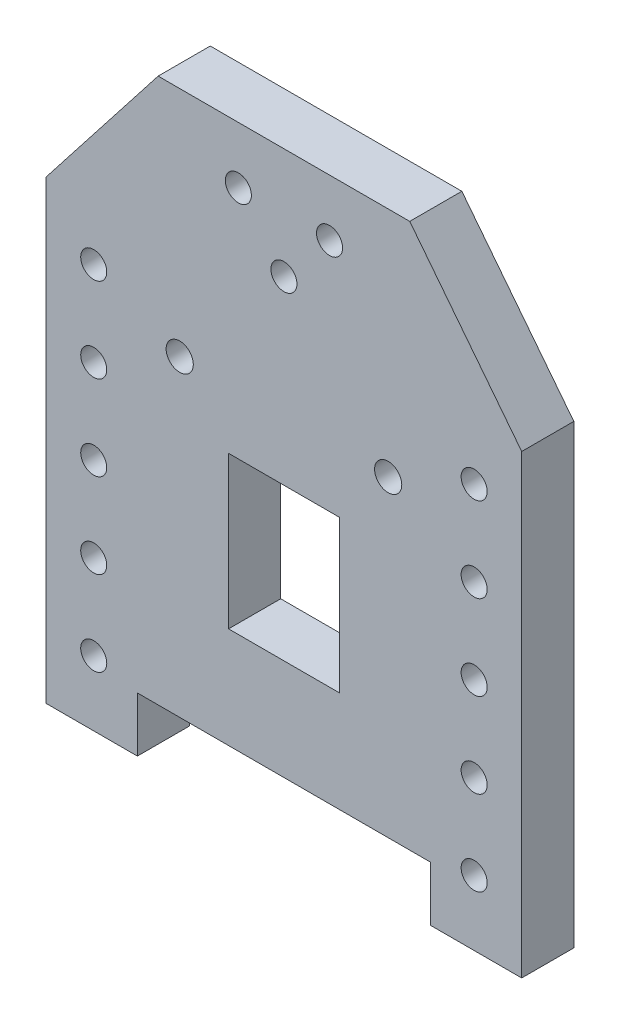
ISO-10303-21;
HEADER;
FILE_DESCRIPTION(('STEP AP214'),'2;1');
FILE_NAME('part.step','',(''),(''),'','','');
FILE_SCHEMA(('AUTOMOTIVE_DESIGN { 1 0 10303 214 1 1 1 1 }'));
ENDSEC;
DATA;
#1=APPLICATION_CONTEXT('core data for automotive mechanical design processes');
#2=APPLICATION_PROTOCOL_DEFINITION('international standard','automotive_design',2000,#1);
#3=PRODUCT_CONTEXT('',#1,'mechanical');
#4=PRODUCT('Part','Part','',(#3));
#5=PRODUCT_RELATED_PRODUCT_CATEGORY('part','',(#4));
#6=PRODUCT_DEFINITION_FORMATION('','',#4);
#7=PRODUCT_DEFINITION_CONTEXT('part definition',#1,'design');
#8=PRODUCT_DEFINITION('design','',#6,#7);
#9=PRODUCT_DEFINITION_SHAPE('','',#8);
#10=(LENGTH_UNIT() NAMED_UNIT(*) SI_UNIT(.MILLI.,.METRE.));
#11=(NAMED_UNIT(*) PLANE_ANGLE_UNIT() SI_UNIT($,.RADIAN.));
#12=(NAMED_UNIT(*) SI_UNIT($,.STERADIAN.) SOLID_ANGLE_UNIT());
#13=UNCERTAINTY_MEASURE_WITH_UNIT(LENGTH_MEASURE(1.E-05),#10,'distance_accuracy_value','');
#14=(GEOMETRIC_REPRESENTATION_CONTEXT(3) GLOBAL_UNCERTAINTY_ASSIGNED_CONTEXT((#13)) GLOBAL_UNIT_ASSIGNED_CONTEXT((#10,
#11,#12)) REPRESENTATION_CONTEXT('',''));
#15=CARTESIAN_POINT('',(0.,0.,0.));
#16=DIRECTION('',(0.,0.,1.));
#17=DIRECTION('',(1.,0.,0.));
#18=AXIS2_PLACEMENT_3D('',#15,#16,#17);
#19=CARTESIAN_POINT('',(0.,0.,8.));
#20=DIRECTION('',(0.,0.,1.));
#21=DIRECTION('',(1.,0.,0.));
#22=AXIS2_PLACEMENT_3D('',#19,#20,#21);
#23=PLANE('',#22);
#24=CARTESIAN_POINT('',(29.2000000000002,62.,8.));
#25=DIRECTION('',(0.,0.,-1.));
#26=DIRECTION('',(-1.,0.,0.));
#27=AXIS2_PLACEMENT_3D('',#24,#25,#26);
#28=CIRCLE('',#27,1.99999999999999);
#29=CARTESIAN_POINT('',(27.2000000000002,62.,8.));
#30=VERTEX_POINT('',#29);
#31=EDGE_CURVE('E579',#30,#30,#28,.T.);
#32=ORIENTED_EDGE('',*,*,#31,.T.);
#33=EDGE_LOOP('',(#32));
#34=FACE_BOUND('',#33,.T.);
#35=CARTESIAN_POINT('',(29.2000000000001,49.,8.));
#36=DIRECTION('',(0.,0.,-1.));
#37=DIRECTION('',(-1.,0.,0.));
#38=AXIS2_PLACEMENT_3D('',#35,#36,#37);
#39=CIRCLE('',#38,1.99999999999998);
#40=CARTESIAN_POINT('',(27.2000000000002,49.,8.));
#41=VERTEX_POINT('',#40);
#42=EDGE_CURVE('E587',#41,#41,#39,.T.);
#43=ORIENTED_EDGE('',*,*,#42,.T.);
#44=EDGE_LOOP('',(#43));
#45=FACE_BOUND('',#44,.T.);
#46=CARTESIAN_POINT('',(29.2000000000001,36.,8.));
#47=DIRECTION('',(0.,0.,-1.));
#48=DIRECTION('',(-1.,0.,0.));
#49=AXIS2_PLACEMENT_3D('',#46,#47,#48);
#50=CIRCLE('',#49,1.99999999999998);
#51=CARTESIAN_POINT('',(27.2000000000001,36.,8.));
#52=VERTEX_POINT('',#51);
#53=EDGE_CURVE('E593',#52,#52,#50,.T.);
#54=ORIENTED_EDGE('',*,*,#53,.T.);
#55=EDGE_LOOP('',(#54));
#56=FACE_BOUND('',#55,.T.);
#57=CARTESIAN_POINT('',(29.2,23.,8.));
#58=DIRECTION('',(0.,0.,-1.));
#59=DIRECTION('',(-1.,0.,0.));
#60=AXIS2_PLACEMENT_3D('',#57,#58,#59);
#61=CIRCLE('',#60,1.99999999999998);
#62=CARTESIAN_POINT('',(27.2000000000001,23.,8.));
#63=VERTEX_POINT('',#62);
#64=EDGE_CURVE('E599',#63,#63,#61,.T.);
#65=ORIENTED_EDGE('',*,*,#64,.T.);
#66=EDGE_LOOP('',(#65));
#67=FACE_BOUND('',#66,.T.);
#68=CARTESIAN_POINT('',(-29.1999999999998,62.,8.));
#69=DIRECTION('',(0.,0.,-1.));
#70=DIRECTION('',(-1.,0.,0.));
#71=AXIS2_PLACEMENT_3D('',#68,#69,#70);
#72=CIRCLE('',#71,1.99999999999999);
#73=CARTESIAN_POINT('',(-31.1999999999998,62.,8.));
#74=VERTEX_POINT('',#73);
#75=EDGE_CURVE('E605',#74,#74,#72,.T.);
#76=ORIENTED_EDGE('',*,*,#75,.T.);
#77=EDGE_LOOP('',(#76));
#78=FACE_BOUND('',#77,.T.);
#79=CARTESIAN_POINT('',(-29.1999999999999,49.,8.));
#80=DIRECTION('',(0.,0.,-1.));
#81=DIRECTION('',(-1.,0.,0.));
#82=AXIS2_PLACEMENT_3D('',#79,#80,#81);
#83=CIRCLE('',#82,1.99999999999998);
#84=CARTESIAN_POINT('',(-31.1999999999999,49.,8.));
#85=VERTEX_POINT('',#84);
#86=EDGE_CURVE('E611',#85,#85,#83,.T.);
#87=ORIENTED_EDGE('',*,*,#86,.T.);
#88=EDGE_LOOP('',(#87));
#89=FACE_BOUND('',#88,.T.);
#90=CARTESIAN_POINT('',(-29.1999999999999,36.,8.));
#91=DIRECTION('',(0.,0.,-1.));
#92=DIRECTION('',(-1.,0.,0.));
#93=AXIS2_PLACEMENT_3D('',#90,#91,#92);
#94=CIRCLE('',#93,1.99999999999998);
#95=CARTESIAN_POINT('',(-31.1999999999999,36.,8.));
#96=VERTEX_POINT('',#95);
#97=EDGE_CURVE('E617',#96,#96,#94,.T.);
#98=ORIENTED_EDGE('',*,*,#97,.T.);
#99=EDGE_LOOP('',(#98));
#100=FACE_BOUND('',#99,.T.);
#101=CARTESIAN_POINT('',(-29.2,23.,8.));
#102=DIRECTION('',(0.,0.,-1.));
#103=DIRECTION('',(-1.,0.,0.));
#104=AXIS2_PLACEMENT_3D('',#101,#102,#103);
#105=CIRCLE('',#104,1.99999999999998);
#106=CARTESIAN_POINT('',(-31.1999999999999,23.,8.));
#107=VERTEX_POINT('',#106);
#108=EDGE_CURVE('E623',#107,#107,#105,.T.);
#109=ORIENTED_EDGE('',*,*,#108,.T.);
#110=EDGE_LOOP('',(#109));
#111=FACE_BOUND('',#110,.T.);
#112=CARTESIAN_POINT('',(-29.2,10.,8.));
#113=DIRECTION('',(0.,0.,1.));
#114=DIRECTION('',(1.,0.,0.));
#115=AXIS2_PLACEMENT_3D('',#112,#113,#114);
#116=CIRCLE('',#115,1.99999999999999);
#117=CARTESIAN_POINT('',(-27.2,10.,8.));
#118=VERTEX_POINT('',#117);
#119=EDGE_CURVE('E635',#118,#118,#116,.T.);
#120=ORIENTED_EDGE('',*,*,#119,.F.);
#121=EDGE_LOOP('',(#120));
#122=FACE_BOUND('',#121,.T.);
#123=CARTESIAN_POINT('',(-7.,83.3,8.));
#124=DIRECTION('',(0.,0.,1.));
#125=DIRECTION('',(1.,0.,0.));
#126=AXIS2_PLACEMENT_3D('',#123,#124,#125);
#127=CIRCLE('',#126,1.99999999999999);
#128=CARTESIAN_POINT('',(-5.00000000000001,83.3,8.));
#129=VERTEX_POINT('',#128);
#130=EDGE_CURVE('E647',#129,#129,#127,.T.);
#131=ORIENTED_EDGE('',*,*,#130,.F.);
#132=EDGE_LOOP('',(#131));
#133=FACE_BOUND('',#132,.T.);
#134=CARTESIAN_POINT('',(16.,56.3545405745842,8.));
#135=DIRECTION('',(0.,0.,1.));
#136=DIRECTION('',(1.,0.,0.));
#137=AXIS2_PLACEMENT_3D('',#134,#135,#136);
#138=CIRCLE('',#137,2.08671795340706);
#139=CARTESIAN_POINT('',(18.0867179534071,56.3545405745842,8.));
#140=VERTEX_POINT('',#139);
#141=EDGE_CURVE('E659',#140,#140,#138,.T.);
#142=ORIENTED_EDGE('',*,*,#141,.F.);
#143=EDGE_LOOP('',(#142));
#144=FACE_BOUND('',#143,.T.);
#145=DIRECTION('',(1.,0.,0.));
#146=VECTOR('',#145,1.);
#147=CARTESIAN_POINT('',(0.,23.9176826946673,8.));
#148=LINE('',#147,#146);
#149=CARTESIAN_POINT('',(-8.5,23.9176826946673,8.));
#150=VERTEX_POINT('',#149);
#151=CARTESIAN_POINT('',(8.5,23.9176826946673,8.));
#152=VERTEX_POINT('',#151);
#153=EDGE_CURVE('E151',#150,#152,#148,.T.);
#154=ORIENTED_EDGE('',*,*,#153,.F.);
#155=DIRECTION('',(0.,-1.,0.));
#156=VECTOR('',#155,1.);
#157=CARTESIAN_POINT('',(-8.5,47.2571297161517,8.));
#158=LINE('',#157,#156);
#159=CARTESIAN_POINT('',(-8.5,47.2571297161517,8.));
#160=VERTEX_POINT('',#159);
#161=EDGE_CURVE('E136',#160,#150,#158,.T.);
#162=ORIENTED_EDGE('',*,*,#161,.F.);
#163=DIRECTION('',(-1.,0.,0.));
#164=VECTOR('',#163,1.);
#165=CARTESIAN_POINT('',(0.,47.2571297161517,8.));
#166=LINE('',#165,#164);
#167=CARTESIAN_POINT('',(8.5,47.2571297161517,8.));
#168=VERTEX_POINT('',#167);
#169=EDGE_CURVE('E131',#168,#160,#166,.T.);
#170=ORIENTED_EDGE('',*,*,#169,.F.);
#171=DIRECTION('',(0.,1.,0.));
#172=VECTOR('',#171,1.);
#173=CARTESIAN_POINT('',(8.5,47.2571297161517,8.));
#174=LINE('',#173,#172);
#175=EDGE_CURVE('E153',#152,#168,#174,.T.);
#176=ORIENTED_EDGE('',*,*,#175,.F.);
#177=EDGE_LOOP('',(#154,#162,#170,#176));
#178=FACE_BOUND('',#177,.T.);
#179=DIRECTION('',(-0.615661475322374,0.788010753609288,0.));
#180=VECTOR('',#179,1.);
#181=CARTESIAN_POINT('',(36.5,70.0000000000001,8.));
#182=LINE('',#181,#180);
#183=CARTESIAN_POINT('',(36.5,70.0000000000001,8.));
#184=VERTEX_POINT('',#183);
#185=CARTESIAN_POINT('',(19.311716217,92.,8.));
#186=VERTEX_POINT('',#185);
#187=EDGE_CURVE('E171',#184,#186,#182,.T.);
#188=ORIENTED_EDGE('',*,*,#187,.T.);
#189=DIRECTION('',(-1.,0.,0.));
#190=VECTOR('',#189,1.);
#191=CARTESIAN_POINT('',(19.311716217,92.,8.));
#192=LINE('',#191,#190);
#193=CARTESIAN_POINT('',(-19.311716217,92.,8.));
#194=VERTEX_POINT('',#193);
#195=EDGE_CURVE('E174',#186,#194,#192,.T.);
#196=ORIENTED_EDGE('',*,*,#195,.T.);
#197=DIRECTION('',(-0.615661475322369,-0.788010753609292,0.));
#198=VECTOR('',#197,1.);
#199=CARTESIAN_POINT('',(-19.311716217,92.,8.));
#200=LINE('',#199,#198);
#201=CARTESIAN_POINT('',(-36.5,69.9999999999999,8.));
#202=VERTEX_POINT('',#201);
#203=EDGE_CURVE('E177',#194,#202,#200,.T.);
#204=ORIENTED_EDGE('',*,*,#203,.T.);
#205=DIRECTION('',(0.,-1.,0.));
#206=VECTOR('',#205,1.);
#207=CARTESIAN_POINT('',(-36.5,69.9999999999999,8.));
#208=LINE('',#207,#206);
#209=CARTESIAN_POINT('',(-36.5,0.,8.));
#210=VERTEX_POINT('',#209);
#211=EDGE_CURVE('E179',#202,#210,#208,.T.);
#212=ORIENTED_EDGE('',*,*,#211,.T.);
#213=DIRECTION('',(1.,0.,0.));
#214=VECTOR('',#213,1.);
#215=CARTESIAN_POINT('',(-36.5,0.,8.));
#216=LINE('',#215,#214);
#217=CARTESIAN_POINT('',(-22.4999999985,0.,8.));
#218=VERTEX_POINT('',#217);
#219=EDGE_CURVE('E181',#210,#218,#216,.T.);
#220=ORIENTED_EDGE('',*,*,#219,.T.);
#221=DIRECTION('',(0.,1.,0.));
#222=VECTOR('',#221,1.);
#223=CARTESIAN_POINT('',(-22.4999999985,0.,8.));
#224=LINE('',#223,#222);
#225=CARTESIAN_POINT('',(-22.4999999985,8.400000004,8.));
#226=VERTEX_POINT('',#225);
#227=EDGE_CURVE('E183',#218,#226,#224,.T.);
#228=ORIENTED_EDGE('',*,*,#227,.T.);
#229=DIRECTION('',(1.,0.,0.));
#230=VECTOR('',#229,1.);
#231=CARTESIAN_POINT('',(-22.4999999985,8.400000004,8.));
#232=LINE('',#231,#230);
#233=CARTESIAN_POINT('',(22.4999999985,8.400000004,8.));
#234=VERTEX_POINT('',#233);
#235=EDGE_CURVE('E185',#226,#234,#232,.T.);
#236=ORIENTED_EDGE('',*,*,#235,.T.);
#237=DIRECTION('',(0.,-1.,0.));
#238=VECTOR('',#237,1.);
#239=CARTESIAN_POINT('',(22.4999999985,8.400000004,8.));
#240=LINE('',#239,#238);
#241=CARTESIAN_POINT('',(22.4999999985,0.,8.));
#242=VERTEX_POINT('',#241);
#243=EDGE_CURVE('E187',#234,#242,#240,.T.);
#244=ORIENTED_EDGE('',*,*,#243,.T.);
#245=DIRECTION('',(1.,0.,0.));
#246=VECTOR('',#245,1.);
#247=CARTESIAN_POINT('',(22.4999999985,0.,8.));
#248=LINE('',#247,#246);
#249=CARTESIAN_POINT('',(36.5,0.,8.));
#250=VERTEX_POINT('',#249);
#251=EDGE_CURVE('E189',#242,#250,#248,.T.);
#252=ORIENTED_EDGE('',*,*,#251,.T.);
#253=DIRECTION('',(0.,1.,0.));
#254=VECTOR('',#253,1.);
#255=CARTESIAN_POINT('',(36.5,0.,8.));
#256=LINE('',#255,#254);
#257=EDGE_CURVE('E191',#250,#184,#256,.T.);
#258=ORIENTED_EDGE('',*,*,#257,.T.);
#259=EDGE_LOOP('',(#188,#196,#204,#212,#220,#228,#236,#244,#252,#258));
#260=FACE_BOUND('',#259,.T.);
#261=CARTESIAN_POINT('',(-16.,56.3545405745842,8.));
#262=DIRECTION('',(0.,0.,1.));
#263=DIRECTION('',(1.,0.,0.));
#264=AXIS2_PLACEMENT_3D('',#261,#262,#263);
#265=CIRCLE('',#264,2.0867160921528);
#266=CARTESIAN_POINT('',(-13.9132839078472,56.3545405745842,8.));
#267=VERTEX_POINT('',#266);
#268=EDGE_CURVE('E160',#267,#267,#265,.T.);
#269=ORIENTED_EDGE('',*,*,#268,.F.);
#270=EDGE_LOOP('',(#269));
#271=FACE_BOUND('',#270,.T.);
#272=CARTESIAN_POINT('',(0.,75.,8.));
#273=DIRECTION('',(0.,0.,1.));
#274=DIRECTION('',(1.,0.,0.));
#275=AXIS2_PLACEMENT_3D('',#272,#273,#274);
#276=CIRCLE('',#275,1.99999999999999);
#277=CARTESIAN_POINT('',(1.99999999999999,75.,8.));
#278=VERTEX_POINT('',#277);
#279=EDGE_CURVE('E653',#278,#278,#276,.T.);
#280=ORIENTED_EDGE('',*,*,#279,.F.);
#281=EDGE_LOOP('',(#280));
#282=FACE_BOUND('',#281,.T.);
#283=CARTESIAN_POINT('',(7.,83.3,8.));
#284=DIRECTION('',(0.,0.,1.));
#285=DIRECTION('',(1.,0.,0.));
#286=AXIS2_PLACEMENT_3D('',#283,#284,#285);
#287=CIRCLE('',#286,1.99999999999999);
#288=CARTESIAN_POINT('',(8.99999999999999,83.3,8.));
#289=VERTEX_POINT('',#288);
#290=EDGE_CURVE('E641',#289,#289,#287,.T.);
#291=ORIENTED_EDGE('',*,*,#290,.F.);
#292=EDGE_LOOP('',(#291));
#293=FACE_BOUND('',#292,.T.);
#294=CARTESIAN_POINT('',(29.2,10.,8.));
#295=DIRECTION('',(0.,0.,1.));
#296=DIRECTION('',(1.,0.,0.));
#297=AXIS2_PLACEMENT_3D('',#294,#295,#296);
#298=CIRCLE('',#297,1.99999999999999);
#299=CARTESIAN_POINT('',(31.2,10.,8.));
#300=VERTEX_POINT('',#299);
#301=EDGE_CURVE('E629',#300,#300,#298,.T.);
#302=ORIENTED_EDGE('',*,*,#301,.F.);
#303=EDGE_LOOP('',(#302));
#304=FACE_BOUND('',#303,.T.);
#305=ADVANCED_FACE('F33',(#34,#45,#56,#67,#78,#89,#100,#111,#122,#133,#144,#178,#260,#271,#282,
#293,#304),#23,.T.);
#306=CARTESIAN_POINT('',(0.,0.,0.));
#307=DIRECTION('',(0.,0.,1.));
#308=DIRECTION('',(1.,0.,0.));
#309=AXIS2_PLACEMENT_3D('',#306,#307,#308);
#310=PLANE('',#309);
#311=CARTESIAN_POINT('',(29.2000000000002,62.,0.));
#312=DIRECTION('',(0.,0.,-1.));
#313=DIRECTION('',(-1.,0.,0.));
#314=AXIS2_PLACEMENT_3D('',#311,#312,#313);
#315=CIRCLE('',#314,1.99999999999999);
#316=CARTESIAN_POINT('',(27.2000000000002,62.,0.));
#317=VERTEX_POINT('',#316);
#318=EDGE_CURVE('E582',#317,#317,#315,.T.);
#319=ORIENTED_EDGE('',*,*,#318,.F.);
#320=EDGE_LOOP('',(#319));
#321=FACE_BOUND('',#320,.T.);
#322=CARTESIAN_POINT('',(29.2000000000001,49.,0.));
#323=DIRECTION('',(0.,0.,-1.));
#324=DIRECTION('',(-1.,0.,0.));
#325=AXIS2_PLACEMENT_3D('',#322,#323,#324);
#326=CIRCLE('',#325,1.99999999999998);
#327=CARTESIAN_POINT('',(27.2000000000002,49.,0.));
#328=VERTEX_POINT('',#327);
#329=EDGE_CURVE('E584',#328,#328,#326,.T.);
#330=ORIENTED_EDGE('',*,*,#329,.F.);
#331=EDGE_LOOP('',(#330));
#332=FACE_BOUND('',#331,.T.);
#333=CARTESIAN_POINT('',(29.2000000000001,36.,0.));
#334=DIRECTION('',(0.,0.,-1.));
#335=DIRECTION('',(-1.,0.,0.));
#336=AXIS2_PLACEMENT_3D('',#333,#334,#335);
#337=CIRCLE('',#336,1.99999999999998);
#338=CARTESIAN_POINT('',(27.2000000000001,36.,0.));
#339=VERTEX_POINT('',#338);
#340=EDGE_CURVE('E590',#339,#339,#337,.T.);
#341=ORIENTED_EDGE('',*,*,#340,.F.);
#342=EDGE_LOOP('',(#341));
#343=FACE_BOUND('',#342,.T.);
#344=CARTESIAN_POINT('',(29.2,23.,0.));
#345=DIRECTION('',(0.,0.,-1.));
#346=DIRECTION('',(-1.,0.,0.));
#347=AXIS2_PLACEMENT_3D('',#344,#345,#346);
#348=CIRCLE('',#347,1.99999999999998);
#349=CARTESIAN_POINT('',(27.2000000000001,23.,0.));
#350=VERTEX_POINT('',#349);
#351=EDGE_CURVE('E596',#350,#350,#348,.T.);
#352=ORIENTED_EDGE('',*,*,#351,.F.);
#353=EDGE_LOOP('',(#352));
#354=FACE_BOUND('',#353,.T.);
#355=CARTESIAN_POINT('',(-29.1999999999998,62.,0.));
#356=DIRECTION('',(0.,0.,-1.));
#357=DIRECTION('',(-1.,0.,0.));
#358=AXIS2_PLACEMENT_3D('',#355,#356,#357);
#359=CIRCLE('',#358,1.99999999999999);
#360=CARTESIAN_POINT('',(-31.1999999999998,62.,0.));
#361=VERTEX_POINT('',#360);
#362=EDGE_CURVE('E602',#361,#361,#359,.T.);
#363=ORIENTED_EDGE('',*,*,#362,.F.);
#364=EDGE_LOOP('',(#363));
#365=FACE_BOUND('',#364,.T.);
#366=CARTESIAN_POINT('',(-29.1999999999999,49.,0.));
#367=DIRECTION('',(0.,0.,-1.));
#368=DIRECTION('',(-1.,0.,0.));
#369=AXIS2_PLACEMENT_3D('',#366,#367,#368);
#370=CIRCLE('',#369,1.99999999999998);
#371=CARTESIAN_POINT('',(-31.1999999999999,49.,0.));
#372=VERTEX_POINT('',#371);
#373=EDGE_CURVE('E608',#372,#372,#370,.T.);
#374=ORIENTED_EDGE('',*,*,#373,.F.);
#375=EDGE_LOOP('',(#374));
#376=FACE_BOUND('',#375,.T.);
#377=CARTESIAN_POINT('',(-29.1999999999999,36.,0.));
#378=DIRECTION('',(0.,0.,-1.));
#379=DIRECTION('',(-1.,0.,0.));
#380=AXIS2_PLACEMENT_3D('',#377,#378,#379);
#381=CIRCLE('',#380,1.99999999999998);
#382=CARTESIAN_POINT('',(-31.1999999999999,36.,0.));
#383=VERTEX_POINT('',#382);
#384=EDGE_CURVE('E614',#383,#383,#381,.T.);
#385=ORIENTED_EDGE('',*,*,#384,.F.);
#386=EDGE_LOOP('',(#385));
#387=FACE_BOUND('',#386,.T.);
#388=CARTESIAN_POINT('',(-29.2,23.,0.));
#389=DIRECTION('',(0.,0.,-1.));
#390=DIRECTION('',(-1.,0.,0.));
#391=AXIS2_PLACEMENT_3D('',#388,#389,#390);
#392=CIRCLE('',#391,1.99999999999998);
#393=CARTESIAN_POINT('',(-31.1999999999999,23.,0.));
#394=VERTEX_POINT('',#393);
#395=EDGE_CURVE('E620',#394,#394,#392,.T.);
#396=ORIENTED_EDGE('',*,*,#395,.F.);
#397=EDGE_LOOP('',(#396));
#398=FACE_BOUND('',#397,.T.);
#399=CARTESIAN_POINT('',(-29.2,10.,0.));
#400=DIRECTION('',(0.,0.,1.));
#401=DIRECTION('',(1.,0.,0.));
#402=AXIS2_PLACEMENT_3D('',#399,#400,#401);
#403=CIRCLE('',#402,1.99999999999999);
#404=CARTESIAN_POINT('',(-27.2,10.,0.));
#405=VERTEX_POINT('',#404);
#406=EDGE_CURVE('E632',#405,#405,#403,.T.);
#407=ORIENTED_EDGE('',*,*,#406,.T.);
#408=EDGE_LOOP('',(#407));
#409=FACE_BOUND('',#408,.T.);
#410=CARTESIAN_POINT('',(-7.,83.3,0.));
#411=DIRECTION('',(0.,0.,1.));
#412=DIRECTION('',(1.,0.,0.));
#413=AXIS2_PLACEMENT_3D('',#410,#411,#412);
#414=CIRCLE('',#413,1.99999999999999);
#415=CARTESIAN_POINT('',(-5.00000000000001,83.3,0.));
#416=VERTEX_POINT('',#415);
#417=EDGE_CURVE('E644',#416,#416,#414,.T.);
#418=ORIENTED_EDGE('',*,*,#417,.T.);
#419=EDGE_LOOP('',(#418));
#420=FACE_BOUND('',#419,.T.);
#421=CARTESIAN_POINT('',(16.,56.3545405745842,0.));
#422=DIRECTION('',(0.,0.,1.));
#423=DIRECTION('',(1.,0.,0.));
#424=AXIS2_PLACEMENT_3D('',#421,#422,#423);
#425=CIRCLE('',#424,2.08671795340706);
#426=CARTESIAN_POINT('',(18.0867179534071,56.3545405745842,0.));
#427=VERTEX_POINT('',#426);
#428=EDGE_CURVE('E656',#427,#427,#425,.T.);
#429=ORIENTED_EDGE('',*,*,#428,.T.);
#430=EDGE_LOOP('',(#429));
#431=FACE_BOUND('',#430,.T.);
#432=DIRECTION('',(0.,-1.,0.));
#433=VECTOR('',#432,1.);
#434=CARTESIAN_POINT('',(-8.5,47.2571297161517,0.));
#435=LINE('',#434,#433);
#436=CARTESIAN_POINT('',(-8.5,47.2571297161517,0.));
#437=VERTEX_POINT('',#436);
#438=CARTESIAN_POINT('',(-8.5,23.9176826946673,0.));
#439=VERTEX_POINT('',#438);
#440=EDGE_CURVE('E144',#437,#439,#435,.T.);
#441=ORIENTED_EDGE('',*,*,#440,.T.);
#442=DIRECTION('',(1.,0.,0.));
#443=VECTOR('',#442,1.);
#444=CARTESIAN_POINT('',(0.,23.9176826946673,0.));
#445=LINE('',#444,#443);
#446=CARTESIAN_POINT('',(8.5,23.9176826946673,0.));
#447=VERTEX_POINT('',#446);
#448=EDGE_CURVE('E159',#439,#447,#445,.T.);
#449=ORIENTED_EDGE('',*,*,#448,.T.);
#450=DIRECTION('',(0.,1.,0.));
#451=VECTOR('',#450,1.);
#452=CARTESIAN_POINT('',(8.5,47.2571297161517,0.));
#453=LINE('',#452,#451);
#454=CARTESIAN_POINT('',(8.5,47.2571297161517,0.));
#455=VERTEX_POINT('',#454);
#456=EDGE_CURVE('E163',#447,#455,#453,.T.);
#457=ORIENTED_EDGE('',*,*,#456,.T.);
#458=DIRECTION('',(-1.,0.,0.));
#459=VECTOR('',#458,1.);
#460=CARTESIAN_POINT('',(0.,47.2571297161517,0.));
#461=LINE('',#460,#459);
#462=EDGE_CURVE('E137',#455,#437,#461,.T.);
#463=ORIENTED_EDGE('',*,*,#462,.T.);
#464=EDGE_LOOP('',(#441,#449,#457,#463));
#465=FACE_BOUND('',#464,.T.);
#466=DIRECTION('',(-0.615661475322374,0.788010753609288,0.));
#467=VECTOR('',#466,1.);
#468=CARTESIAN_POINT('',(36.5,70.0000000000001,0.));
#469=LINE('',#468,#467);
#470=CARTESIAN_POINT('',(36.5,70.0000000000001,0.));
#471=VERTEX_POINT('',#470);
#472=CARTESIAN_POINT('',(19.311716217,92.,0.));
#473=VERTEX_POINT('',#472);
#474=EDGE_CURVE('E146',#471,#473,#469,.T.);
#475=ORIENTED_EDGE('',*,*,#474,.F.);
#476=DIRECTION('',(0.,1.,0.));
#477=VECTOR('',#476,1.);
#478=CARTESIAN_POINT('',(36.5,0.,0.));
#479=LINE('',#478,#477);
#480=CARTESIAN_POINT('',(36.5,0.,0.));
#481=VERTEX_POINT('',#480);
#482=EDGE_CURVE('E175',#481,#471,#479,.T.);
#483=ORIENTED_EDGE('',*,*,#482,.F.);
#484=DIRECTION('',(1.,0.,0.));
#485=VECTOR('',#484,1.);
#486=CARTESIAN_POINT('',(22.4999999985,0.,0.));
#487=LINE('',#486,#485);
#488=CARTESIAN_POINT('',(22.4999999985,0.,0.));
#489=VERTEX_POINT('',#488);
#490=EDGE_CURVE('E210',#489,#481,#487,.T.);
#491=ORIENTED_EDGE('',*,*,#490,.F.);
#492=DIRECTION('',(0.,-1.,0.));
#493=VECTOR('',#492,1.);
#494=CARTESIAN_POINT('',(22.4999999985,8.400000004,0.));
#495=LINE('',#494,#493);
#496=CARTESIAN_POINT('',(22.4999999985,8.400000004,0.));
#497=VERTEX_POINT('',#496);
#498=EDGE_CURVE('E208',#497,#489,#495,.T.);
#499=ORIENTED_EDGE('',*,*,#498,.F.);
#500=DIRECTION('',(1.,0.,0.));
#501=VECTOR('',#500,1.);
#502=CARTESIAN_POINT('',(-22.4999999985,8.400000004,0.));
#503=LINE('',#502,#501);
#504=CARTESIAN_POINT('',(-22.4999999985,8.400000004,0.));
#505=VERTEX_POINT('',#504);
#506=EDGE_CURVE('E206',#505,#497,#503,.T.);
#507=ORIENTED_EDGE('',*,*,#506,.F.);
#508=DIRECTION('',(0.,1.,0.));
#509=VECTOR('',#508,1.);
#510=CARTESIAN_POINT('',(-22.4999999985,0.,0.));
#511=LINE('',#510,#509);
#512=CARTESIAN_POINT('',(-22.4999999985,0.,0.));
#513=VERTEX_POINT('',#512);
#514=EDGE_CURVE('E204',#513,#505,#511,.T.);
#515=ORIENTED_EDGE('',*,*,#514,.F.);
#516=DIRECTION('',(1.,0.,0.));
#517=VECTOR('',#516,1.);
#518=CARTESIAN_POINT('',(-36.5,0.,0.));
#519=LINE('',#518,#517);
#520=CARTESIAN_POINT('',(-36.5,0.,0.));
#521=VERTEX_POINT('',#520);
#522=EDGE_CURVE('E202',#521,#513,#519,.T.);
#523=ORIENTED_EDGE('',*,*,#522,.F.);
#524=DIRECTION('',(0.,-1.,0.));
#525=VECTOR('',#524,1.);
#526=CARTESIAN_POINT('',(-36.5,69.9999999999999,0.));
#527=LINE('',#526,#525);
#528=CARTESIAN_POINT('',(-36.5,69.9999999999999,0.));
#529=VERTEX_POINT('',#528);
#530=EDGE_CURVE('E200',#529,#521,#527,.T.);
#531=ORIENTED_EDGE('',*,*,#530,.F.);
#532=DIRECTION('',(-0.615661475322369,-0.788010753609292,0.));
#533=VECTOR('',#532,1.);
#534=CARTESIAN_POINT('',(-19.311716217,92.,0.));
#535=LINE('',#534,#533);
#536=CARTESIAN_POINT('',(-19.311716217,92.,0.));
#537=VERTEX_POINT('',#536);
#538=EDGE_CURVE('E198',#537,#529,#535,.T.);
#539=ORIENTED_EDGE('',*,*,#538,.F.);
#540=DIRECTION('',(-1.,0.,0.));
#541=VECTOR('',#540,1.);
#542=CARTESIAN_POINT('',(19.311716217,92.,0.));
#543=LINE('',#542,#541);
#544=EDGE_CURVE('E196',#473,#537,#543,.T.);
#545=ORIENTED_EDGE('',*,*,#544,.F.);
#546=EDGE_LOOP('',(#475,#483,#491,#499,#507,#515,#523,#531,#539,#545));
#547=FACE_BOUND('',#546,.T.);
#548=CARTESIAN_POINT('',(-16.,56.3545405745842,0.));
#549=DIRECTION('',(0.,0.,1.));
#550=DIRECTION('',(1.,0.,0.));
#551=AXIS2_PLACEMENT_3D('',#548,#549,#550);
#552=CIRCLE('',#551,2.0867160921528);
#553=CARTESIAN_POINT('',(-13.9132839078472,56.3545405745842,0.));
#554=VERTEX_POINT('',#553);
#555=EDGE_CURVE('E662',#554,#554,#552,.T.);
#556=ORIENTED_EDGE('',*,*,#555,.T.);
#557=EDGE_LOOP('',(#556));
#558=FACE_BOUND('',#557,.T.);
#559=CARTESIAN_POINT('',(0.,75.,0.));
#560=DIRECTION('',(0.,0.,1.));
#561=DIRECTION('',(1.,0.,0.));
#562=AXIS2_PLACEMENT_3D('',#559,#560,#561);
#563=CIRCLE('',#562,1.99999999999999);
#564=CARTESIAN_POINT('',(1.99999999999999,75.,0.));
#565=VERTEX_POINT('',#564);
#566=EDGE_CURVE('E650',#565,#565,#563,.T.);
#567=ORIENTED_EDGE('',*,*,#566,.T.);
#568=EDGE_LOOP('',(#567));
#569=FACE_BOUND('',#568,.T.);
#570=CARTESIAN_POINT('',(7.,83.3,0.));
#571=DIRECTION('',(0.,0.,1.));
#572=DIRECTION('',(1.,0.,0.));
#573=AXIS2_PLACEMENT_3D('',#570,#571,#572);
#574=CIRCLE('',#573,1.99999999999999);
#575=CARTESIAN_POINT('',(8.99999999999999,83.3,0.));
#576=VERTEX_POINT('',#575);
#577=EDGE_CURVE('E638',#576,#576,#574,.T.);
#578=ORIENTED_EDGE('',*,*,#577,.T.);
#579=EDGE_LOOP('',(#578));
#580=FACE_BOUND('',#579,.T.);
#581=CARTESIAN_POINT('',(29.2,10.,0.));
#582=DIRECTION('',(0.,0.,1.));
#583=DIRECTION('',(1.,0.,0.));
#584=AXIS2_PLACEMENT_3D('',#581,#582,#583);
#585=CIRCLE('',#584,1.99999999999999);
#586=CARTESIAN_POINT('',(31.2,10.,0.));
#587=VERTEX_POINT('',#586);
#588=EDGE_CURVE('E626',#587,#587,#585,.T.);
#589=ORIENTED_EDGE('',*,*,#588,.T.);
#590=EDGE_LOOP('',(#589));
#591=FACE_BOUND('',#590,.T.);
#592=ADVANCED_FACE('F246',(#321,#332,#343,#354,#365,#376,#387,#398,#409,#420,#431,#465,#547,
#558,#569,#580,#591),#310,.F.);
#593=CARTESIAN_POINT('',(36.5,70.0000000000001,8.));
#594=DIRECTION('',(-0.788010753609288,-0.615661475322374,0.));
#595=DIRECTION('',(0.615661475322374,-0.788010753609288,0.));
#596=AXIS2_PLACEMENT_3D('',#593,#594,#595);
#597=PLANE('',#596);
#598=ORIENTED_EDGE('',*,*,#474,.T.);
#599=DIRECTION('',(0.,0.,-1.));
#600=VECTOR('',#599,1.);
#601=CARTESIAN_POINT('',(19.311716217,92.,8.));
#602=LINE('',#601,#600);
#603=EDGE_CURVE('E11',#186,#473,#602,.T.);
#604=ORIENTED_EDGE('',*,*,#603,.F.);
#605=ORIENTED_EDGE('',*,*,#187,.F.);
#606=DIRECTION('',(0.,0.,-1.));
#607=VECTOR('',#606,1.);
#608=CARTESIAN_POINT('',(36.5,70.0000000000001,8.));
#609=LINE('',#608,#607);
#610=EDGE_CURVE('E193',#184,#471,#609,.T.);
#611=ORIENTED_EDGE('',*,*,#610,.T.);
#612=EDGE_LOOP('',(#598,#604,#605,#611));
#613=FACE_BOUND('',#612,.T.);
#614=ADVANCED_FACE('F35',(#613),#597,.F.);
#615=CARTESIAN_POINT('',(19.311716217,92.,8.));
#616=DIRECTION('',(0.,-1.,0.));
#617=DIRECTION('',(0.,0.,-1.));
#618=AXIS2_PLACEMENT_3D('',#615,#616,#617);
#619=PLANE('',#618);
#620=ORIENTED_EDGE('',*,*,#544,.T.);
#621=DIRECTION('',(0.,0.,-1.));
#622=VECTOR('',#621,1.);
#623=CARTESIAN_POINT('',(-19.311716217,92.,8.));
#624=LINE('',#623,#622);
#625=EDGE_CURVE('E41',#194,#537,#624,.T.);
#626=ORIENTED_EDGE('',*,*,#625,.F.);
#627=ORIENTED_EDGE('',*,*,#195,.F.);
#628=ORIENTED_EDGE('',*,*,#603,.T.);
#629=EDGE_LOOP('',(#620,#626,#627,#628));
#630=FACE_BOUND('',#629,.T.);
#631=ADVANCED_FACE('F263',(#630),#619,.F.);
#632=CARTESIAN_POINT('',(-19.311716217,92.,8.));
#633=DIRECTION('',(0.788010753609292,-0.615661475322369,0.));
#634=DIRECTION('',(0.615661475322369,0.788010753609292,0.));
#635=AXIS2_PLACEMENT_3D('',#632,#633,#634);
#636=PLANE('',#635);
#637=ORIENTED_EDGE('',*,*,#538,.T.);
#638=DIRECTION('',(0.,0.,-1.));
#639=VECTOR('',#638,1.);
#640=CARTESIAN_POINT('',(-36.5,69.9999999999999,8.));
#641=LINE('',#640,#639);
#642=EDGE_CURVE('E233',#202,#529,#641,.T.);
#643=ORIENTED_EDGE('',*,*,#642,.F.);
#644=ORIENTED_EDGE('',*,*,#203,.F.);
#645=ORIENTED_EDGE('',*,*,#625,.T.);
#646=EDGE_LOOP('',(#637,#643,#644,#645));
#647=FACE_BOUND('',#646,.T.);
#648=ADVANCED_FACE('F240',(#647),#636,.F.);
#649=CARTESIAN_POINT('',(-36.5,69.9999999999999,8.));
#650=DIRECTION('',(1.,0.,0.));
#651=DIRECTION('',(0.,0.,-1.));
#652=AXIS2_PLACEMENT_3D('',#649,#650,#651);
#653=PLANE('',#652);
#654=ORIENTED_EDGE('',*,*,#530,.T.);
#655=DIRECTION('',(0.,0.,-1.));
#656=VECTOR('',#655,1.);
#657=CARTESIAN_POINT('',(-36.5,0.,8.));
#658=LINE('',#657,#656);
#659=EDGE_CURVE('E230',#210,#521,#658,.T.);
#660=ORIENTED_EDGE('',*,*,#659,.F.);
#661=ORIENTED_EDGE('',*,*,#211,.F.);
#662=ORIENTED_EDGE('',*,*,#642,.T.);
#663=EDGE_LOOP('',(#654,#660,#661,#662));
#664=FACE_BOUND('',#663,.T.);
#665=ADVANCED_FACE('F252',(#664),#653,.F.);
#666=CARTESIAN_POINT('',(-36.5,0.,8.));
#667=DIRECTION('',(0.,1.,0.));
#668=DIRECTION('',(0.,0.,1.));
#669=AXIS2_PLACEMENT_3D('',#666,#667,#668);
#670=PLANE('',#669);
#671=ORIENTED_EDGE('',*,*,#522,.T.);
#672=DIRECTION('',(0.,0.,-1.));
#673=VECTOR('',#672,1.);
#674=CARTESIAN_POINT('',(-22.4999999985,0.,8.));
#675=LINE('',#674,#673);
#676=EDGE_CURVE('E227',#218,#513,#675,.T.);
#677=ORIENTED_EDGE('',*,*,#676,.F.);
#678=ORIENTED_EDGE('',*,*,#219,.F.);
#679=ORIENTED_EDGE('',*,*,#659,.T.);
#680=EDGE_LOOP('',(#671,#677,#678,#679));
#681=FACE_BOUND('',#680,.T.);
#682=ADVANCED_FACE('F256',(#681),#670,.F.);
#683=CARTESIAN_POINT('',(-22.4999999985,0.,8.));
#684=DIRECTION('',(-1.,0.,0.));
#685=DIRECTION('',(0.,0.,1.));
#686=AXIS2_PLACEMENT_3D('',#683,#684,#685);
#687=PLANE('',#686);
#688=ORIENTED_EDGE('',*,*,#514,.T.);
#689=DIRECTION('',(0.,0.,-1.));
#690=VECTOR('',#689,1.);
#691=CARTESIAN_POINT('',(-22.4999999985,8.400000004,8.));
#692=LINE('',#691,#690);
#693=EDGE_CURVE('E224',#226,#505,#692,.T.);
#694=ORIENTED_EDGE('',*,*,#693,.F.);
#695=ORIENTED_EDGE('',*,*,#227,.F.);
#696=ORIENTED_EDGE('',*,*,#676,.T.);
#697=EDGE_LOOP('',(#688,#694,#695,#696));
#698=FACE_BOUND('',#697,.T.);
#699=ADVANCED_FACE('F286',(#698),#687,.F.);
#700=CARTESIAN_POINT('',(-22.4999999985,8.400000004,8.));
#701=DIRECTION('',(0.,1.,0.));
#702=DIRECTION('',(0.,0.,1.));
#703=AXIS2_PLACEMENT_3D('',#700,#701,#702);
#704=PLANE('',#703);
#705=ORIENTED_EDGE('',*,*,#506,.T.);
#706=DIRECTION('',(0.,0.,-1.));
#707=VECTOR('',#706,1.);
#708=CARTESIAN_POINT('',(22.4999999985,8.400000004,8.));
#709=LINE('',#708,#707);
#710=EDGE_CURVE('E221',#234,#497,#709,.T.);
#711=ORIENTED_EDGE('',*,*,#710,.F.);
#712=ORIENTED_EDGE('',*,*,#235,.F.);
#713=ORIENTED_EDGE('',*,*,#693,.T.);
#714=EDGE_LOOP('',(#705,#711,#712,#713));
#715=FACE_BOUND('',#714,.T.);
#716=ADVANCED_FACE('F283',(#715),#704,.F.);
#717=CARTESIAN_POINT('',(22.4999999985,8.400000004,8.));
#718=DIRECTION('',(1.,0.,0.));
#719=DIRECTION('',(0.,0.,-1.));
#720=AXIS2_PLACEMENT_3D('',#717,#718,#719);
#721=PLANE('',#720);
#722=ORIENTED_EDGE('',*,*,#498,.T.);
#723=DIRECTION('',(0.,0.,-1.));
#724=VECTOR('',#723,1.);
#725=CARTESIAN_POINT('',(22.4999999985,0.,8.));
#726=LINE('',#725,#724);
#727=EDGE_CURVE('E218',#242,#489,#726,.T.);
#728=ORIENTED_EDGE('',*,*,#727,.F.);
#729=ORIENTED_EDGE('',*,*,#243,.F.);
#730=ORIENTED_EDGE('',*,*,#710,.T.);
#731=EDGE_LOOP('',(#722,#728,#729,#730));
#732=FACE_BOUND('',#731,.T.);
#733=ADVANCED_FACE('F279',(#732),#721,.F.);
#734=CARTESIAN_POINT('',(22.4999999985,0.,8.));
#735=DIRECTION('',(0.,1.,0.));
#736=DIRECTION('',(0.,0.,1.));
#737=AXIS2_PLACEMENT_3D('',#734,#735,#736);
#738=PLANE('',#737);
#739=ORIENTED_EDGE('',*,*,#490,.T.);
#740=DIRECTION('',(0.,0.,-1.));
#741=VECTOR('',#740,1.);
#742=CARTESIAN_POINT('',(36.5,0.,8.));
#743=LINE('',#742,#741);
#744=EDGE_CURVE('E215',#250,#481,#743,.T.);
#745=ORIENTED_EDGE('',*,*,#744,.F.);
#746=ORIENTED_EDGE('',*,*,#251,.F.);
#747=ORIENTED_EDGE('',*,*,#727,.T.);
#748=EDGE_LOOP('',(#739,#745,#746,#747));
#749=FACE_BOUND('',#748,.T.);
#750=ADVANCED_FACE('F275',(#749),#738,.F.);
#751=CARTESIAN_POINT('',(36.5,0.,8.));
#752=DIRECTION('',(-1.,0.,0.));
#753=DIRECTION('',(0.,-1.,0.));
#754=AXIS2_PLACEMENT_3D('',#751,#752,#753);
#755=PLANE('',#754);
#756=ORIENTED_EDGE('',*,*,#482,.T.);
#757=ORIENTED_EDGE('',*,*,#610,.F.);
#758=ORIENTED_EDGE('',*,*,#257,.F.);
#759=ORIENTED_EDGE('',*,*,#744,.T.);
#760=EDGE_LOOP('',(#756,#757,#758,#759));
#761=FACE_BOUND('',#760,.T.);
#762=ADVANCED_FACE('F270',(#761),#755,.F.);
#763=CARTESIAN_POINT('',(-8.5,47.2571297161517,8.));
#764=DIRECTION('',(1.,0.,0.));
#765=DIRECTION('',(0.,0.,-1.));
#766=AXIS2_PLACEMENT_3D('',#763,#764,#765);
#767=PLANE('',#766);
#768=ORIENTED_EDGE('',*,*,#440,.F.);
#769=DIRECTION('',(0.,0.,-1.));
#770=VECTOR('',#769,1.);
#771=CARTESIAN_POINT('',(-8.5,47.2571297161517,8.));
#772=LINE('',#771,#770);
#773=EDGE_CURVE('E53',#160,#437,#772,.T.);
#774=ORIENTED_EDGE('',*,*,#773,.F.);
#775=ORIENTED_EDGE('',*,*,#161,.T.);
#776=DIRECTION('',(0.,0.,-1.));
#777=VECTOR('',#776,1.);
#778=CARTESIAN_POINT('',(-8.5,23.9176826946673,8.));
#779=LINE('',#778,#777);
#780=EDGE_CURVE('E147',#150,#439,#779,.T.);
#781=ORIENTED_EDGE('',*,*,#780,.T.);
#782=EDGE_LOOP('',(#768,#774,#775,#781));
#783=FACE_BOUND('',#782,.T.);
#784=ADVANCED_FACE('F140',(#783),#767,.T.);
#785=CARTESIAN_POINT('',(0.,23.9176826946673,8.));
#786=DIRECTION('',(0.,1.,0.));
#787=DIRECTION('',(0.,0.,1.));
#788=AXIS2_PLACEMENT_3D('',#785,#786,#787);
#789=PLANE('',#788);
#790=ORIENTED_EDGE('',*,*,#448,.F.);
#791=ORIENTED_EDGE('',*,*,#780,.F.);
#792=ORIENTED_EDGE('',*,*,#153,.T.);
#793=DIRECTION('',(0.,0.,-1.));
#794=VECTOR('',#793,1.);
#795=CARTESIAN_POINT('',(8.5,23.9176826946673,8.));
#796=LINE('',#795,#794);
#797=EDGE_CURVE('E168',#152,#447,#796,.T.);
#798=ORIENTED_EDGE('',*,*,#797,.T.);
#799=EDGE_LOOP('',(#790,#791,#792,#798));
#800=FACE_BOUND('',#799,.T.);
#801=ADVANCED_FACE('F332',(#800),#789,.T.);
#802=CARTESIAN_POINT('',(8.5,47.2571297161517,8.));
#803=DIRECTION('',(-1.,0.,0.));
#804=DIRECTION('',(0.,0.,1.));
#805=AXIS2_PLACEMENT_3D('',#802,#803,#804);
#806=PLANE('',#805);
#807=ORIENTED_EDGE('',*,*,#456,.F.);
#808=ORIENTED_EDGE('',*,*,#797,.F.);
#809=ORIENTED_EDGE('',*,*,#175,.T.);
#810=DIRECTION('',(0.,0.,-1.));
#811=VECTOR('',#810,1.);
#812=CARTESIAN_POINT('',(8.5,47.2571297161517,8.));
#813=LINE('',#812,#811);
#814=EDGE_CURVE('E48',#168,#455,#813,.T.);
#815=ORIENTED_EDGE('',*,*,#814,.T.);
#816=EDGE_LOOP('',(#807,#808,#809,#815));
#817=FACE_BOUND('',#816,.T.);
#818=ADVANCED_FACE('F338',(#817),#806,.T.);
#819=CARTESIAN_POINT('',(0.,47.2571297161517,8.));
#820=DIRECTION('',(0.,-1.,0.));
#821=DIRECTION('',(0.,0.,-1.));
#822=AXIS2_PLACEMENT_3D('',#819,#820,#821);
#823=PLANE('',#822);
#824=ORIENTED_EDGE('',*,*,#462,.F.);
#825=ORIENTED_EDGE('',*,*,#814,.F.);
#826=ORIENTED_EDGE('',*,*,#169,.T.);
#827=ORIENTED_EDGE('',*,*,#773,.T.);
#828=EDGE_LOOP('',(#824,#825,#826,#827));
#829=FACE_BOUND('',#828,.T.);
#830=ADVANCED_FACE('F132',(#829),#823,.T.);
#831=CARTESIAN_POINT('',(-16.,56.3545405745842,8.));
#832=DIRECTION('',(0.,0.,-1.));
#833=DIRECTION('',(-1.,0.,0.));
#834=AXIS2_PLACEMENT_3D('',#831,#832,#833);
#835=CYLINDRICAL_SURFACE('',#834,2.0867160921528);
#836=ORIENTED_EDGE('',*,*,#268,.T.);
#837=EDGE_LOOP('',(#836));
#838=FACE_BOUND('',#837,.T.);
#839=ORIENTED_EDGE('',*,*,#555,.F.);
#840=EDGE_LOOP('',(#839));
#841=FACE_BOUND('',#840,.T.);
#842=ADVANCED_FACE('F352',(#838,#841),#835,.F.);
#843=CARTESIAN_POINT('',(16.,56.3545405745842,8.));
#844=DIRECTION('',(0.,0.,-1.));
#845=DIRECTION('',(-1.,0.,0.));
#846=AXIS2_PLACEMENT_3D('',#843,#844,#845);
#847=CYLINDRICAL_SURFACE('',#846,2.08671795340706);
#848=ORIENTED_EDGE('',*,*,#141,.T.);
#849=EDGE_LOOP('',(#848));
#850=FACE_BOUND('',#849,.T.);
#851=ORIENTED_EDGE('',*,*,#428,.F.);
#852=EDGE_LOOP('',(#851));
#853=FACE_BOUND('',#852,.T.);
#854=ADVANCED_FACE('F359',(#850,#853),#847,.F.);
#855=CARTESIAN_POINT('',(0.,75.,8.));
#856=DIRECTION('',(0.,0.,-1.));
#857=DIRECTION('',(-1.,0.,0.));
#858=AXIS2_PLACEMENT_3D('',#855,#856,#857);
#859=CYLINDRICAL_SURFACE('',#858,1.99999999999999);
#860=ORIENTED_EDGE('',*,*,#279,.T.);
#861=EDGE_LOOP('',(#860));
#862=FACE_BOUND('',#861,.T.);
#863=ORIENTED_EDGE('',*,*,#566,.F.);
#864=EDGE_LOOP('',(#863));
#865=FACE_BOUND('',#864,.T.);
#866=ADVANCED_FACE('F367',(#862,#865),#859,.F.);
#867=CARTESIAN_POINT('',(-7.,83.3,8.));
#868=DIRECTION('',(0.,0.,-1.));
#869=DIRECTION('',(-1.,0.,0.));
#870=AXIS2_PLACEMENT_3D('',#867,#868,#869);
#871=CYLINDRICAL_SURFACE('',#870,1.99999999999999);
#872=ORIENTED_EDGE('',*,*,#130,.T.);
#873=EDGE_LOOP('',(#872));
#874=FACE_BOUND('',#873,.T.);
#875=ORIENTED_EDGE('',*,*,#417,.F.);
#876=EDGE_LOOP('',(#875));
#877=FACE_BOUND('',#876,.T.);
#878=ADVANCED_FACE('F375',(#874,#877),#871,.F.);
#879=CARTESIAN_POINT('',(7.,83.3,8.));
#880=DIRECTION('',(0.,0.,-1.));
#881=DIRECTION('',(-1.,0.,0.));
#882=AXIS2_PLACEMENT_3D('',#879,#880,#881);
#883=CYLINDRICAL_SURFACE('',#882,1.99999999999999);
#884=ORIENTED_EDGE('',*,*,#290,.T.);
#885=EDGE_LOOP('',(#884));
#886=FACE_BOUND('',#885,.T.);
#887=ORIENTED_EDGE('',*,*,#577,.F.);
#888=EDGE_LOOP('',(#887));
#889=FACE_BOUND('',#888,.T.);
#890=ADVANCED_FACE('F383',(#886,#889),#883,.F.);
#891=CARTESIAN_POINT('',(-29.2,10.,8.));
#892=DIRECTION('',(0.,0.,-1.));
#893=DIRECTION('',(-1.,0.,0.));
#894=AXIS2_PLACEMENT_3D('',#891,#892,#893);
#895=CYLINDRICAL_SURFACE('',#894,1.99999999999999);
#896=ORIENTED_EDGE('',*,*,#119,.T.);
#897=EDGE_LOOP('',(#896));
#898=FACE_BOUND('',#897,.T.);
#899=ORIENTED_EDGE('',*,*,#406,.F.);
#900=EDGE_LOOP('',(#899));
#901=FACE_BOUND('',#900,.T.);
#902=ADVANCED_FACE('F391',(#898,#901),#895,.F.);
#903=CARTESIAN_POINT('',(29.2,10.,8.));
#904=DIRECTION('',(0.,0.,-1.));
#905=DIRECTION('',(-1.,0.,0.));
#906=AXIS2_PLACEMENT_3D('',#903,#904,#905);
#907=CYLINDRICAL_SURFACE('',#906,1.99999999999999);
#908=ORIENTED_EDGE('',*,*,#301,.T.);
#909=EDGE_LOOP('',(#908));
#910=FACE_BOUND('',#909,.T.);
#911=ORIENTED_EDGE('',*,*,#588,.F.);
#912=EDGE_LOOP('',(#911));
#913=FACE_BOUND('',#912,.T.);
#914=ADVANCED_FACE('F399',(#910,#913),#907,.F.);
#915=CARTESIAN_POINT('',(-29.2,23.,8.));
#916=DIRECTION('',(0.,0.,-1.));
#917=DIRECTION('',(-1.,0.,0.));
#918=AXIS2_PLACEMENT_3D('',#915,#916,#917);
#919=CYLINDRICAL_SURFACE('',#918,1.99999999999998);
#920=ORIENTED_EDGE('',*,*,#108,.F.);
#921=EDGE_LOOP('',(#920));
#922=FACE_BOUND('',#921,.T.);
#923=ORIENTED_EDGE('',*,*,#395,.T.);
#924=EDGE_LOOP('',(#923));
#925=FACE_BOUND('',#924,.T.);
#926=ADVANCED_FACE('F406',(#922,#925),#919,.F.);
#927=CARTESIAN_POINT('',(-29.1999999999999,36.,8.));
#928=DIRECTION('',(0.,0.,-1.));
#929=DIRECTION('',(-1.,0.,0.));
#930=AXIS2_PLACEMENT_3D('',#927,#928,#929);
#931=CYLINDRICAL_SURFACE('',#930,1.99999999999998);
#932=ORIENTED_EDGE('',*,*,#97,.F.);
#933=EDGE_LOOP('',(#932));
#934=FACE_BOUND('',#933,.T.);
#935=ORIENTED_EDGE('',*,*,#384,.T.);
#936=EDGE_LOOP('',(#935));
#937=FACE_BOUND('',#936,.T.);
#938=ADVANCED_FACE('F414',(#934,#937),#931,.F.);
#939=CARTESIAN_POINT('',(-29.1999999999999,49.,8.));
#940=DIRECTION('',(0.,0.,-1.));
#941=DIRECTION('',(-1.,0.,0.));
#942=AXIS2_PLACEMENT_3D('',#939,#940,#941);
#943=CYLINDRICAL_SURFACE('',#942,1.99999999999998);
#944=ORIENTED_EDGE('',*,*,#86,.F.);
#945=EDGE_LOOP('',(#944));
#946=FACE_BOUND('',#945,.T.);
#947=ORIENTED_EDGE('',*,*,#373,.T.);
#948=EDGE_LOOP('',(#947));
#949=FACE_BOUND('',#948,.T.);
#950=ADVANCED_FACE('F422',(#946,#949),#943,.F.);
#951=CARTESIAN_POINT('',(-29.1999999999998,62.,8.));
#952=DIRECTION('',(0.,0.,-1.));
#953=DIRECTION('',(-1.,0.,0.));
#954=AXIS2_PLACEMENT_3D('',#951,#952,#953);
#955=CYLINDRICAL_SURFACE('',#954,1.99999999999999);
#956=ORIENTED_EDGE('',*,*,#75,.F.);
#957=EDGE_LOOP('',(#956));
#958=FACE_BOUND('',#957,.T.);
#959=ORIENTED_EDGE('',*,*,#362,.T.);
#960=EDGE_LOOP('',(#959));
#961=FACE_BOUND('',#960,.T.);
#962=ADVANCED_FACE('F430',(#958,#961),#955,.F.);
#963=CARTESIAN_POINT('',(29.2,23.,8.));
#964=DIRECTION('',(0.,0.,-1.));
#965=DIRECTION('',(-1.,0.,0.));
#966=AXIS2_PLACEMENT_3D('',#963,#964,#965);
#967=CYLINDRICAL_SURFACE('',#966,1.99999999999998);
#968=ORIENTED_EDGE('',*,*,#64,.F.);
#969=EDGE_LOOP('',(#968));
#970=FACE_BOUND('',#969,.T.);
#971=ORIENTED_EDGE('',*,*,#351,.T.);
#972=EDGE_LOOP('',(#971));
#973=FACE_BOUND('',#972,.T.);
#974=ADVANCED_FACE('F438',(#970,#973),#967,.F.);
#975=CARTESIAN_POINT('',(29.2000000000001,36.,8.));
#976=DIRECTION('',(0.,0.,-1.));
#977=DIRECTION('',(-1.,0.,0.));
#978=AXIS2_PLACEMENT_3D('',#975,#976,#977);
#979=CYLINDRICAL_SURFACE('',#978,1.99999999999998);
#980=ORIENTED_EDGE('',*,*,#53,.F.);
#981=EDGE_LOOP('',(#980));
#982=FACE_BOUND('',#981,.T.);
#983=ORIENTED_EDGE('',*,*,#340,.T.);
#984=EDGE_LOOP('',(#983));
#985=FACE_BOUND('',#984,.T.);
#986=ADVANCED_FACE('F446',(#982,#985),#979,.F.);
#987=CARTESIAN_POINT('',(29.2000000000001,49.,8.));
#988=DIRECTION('',(0.,0.,-1.));
#989=DIRECTION('',(-1.,0.,0.));
#990=AXIS2_PLACEMENT_3D('',#987,#988,#989);
#991=CYLINDRICAL_SURFACE('',#990,1.99999999999998);
#992=ORIENTED_EDGE('',*,*,#42,.F.);
#993=EDGE_LOOP('',(#992));
#994=FACE_BOUND('',#993,.T.);
#995=ORIENTED_EDGE('',*,*,#329,.T.);
#996=EDGE_LOOP('',(#995));
#997=FACE_BOUND('',#996,.T.);
#998=ADVANCED_FACE('F454',(#994,#997),#991,.F.);
#999=CARTESIAN_POINT('',(29.2000000000002,62.,8.));
#1000=DIRECTION('',(0.,0.,-1.));
#1001=DIRECTION('',(-1.,0.,0.));
#1002=AXIS2_PLACEMENT_3D('',#999,#1000,#1001);
#1003=CYLINDRICAL_SURFACE('',#1002,1.99999999999999);
#1004=ORIENTED_EDGE('',*,*,#31,.F.);
#1005=EDGE_LOOP('',(#1004));
#1006=FACE_BOUND('',#1005,.T.);
#1007=ORIENTED_EDGE('',*,*,#318,.T.);
#1008=EDGE_LOOP('',(#1007));
#1009=FACE_BOUND('',#1008,.T.);
#1010=ADVANCED_FACE('F462',(#1006,#1009),#1003,.F.);
#1011=CLOSED_SHELL('',(#305,#592,#614,#631,#648,#665,#682,#699,#716,#733,#750,#762,#784,#801,
#818,#830,#842,#854,#866,#878,#890,#902,#914,#926,#938,#950,#962,#974,#986,#998,#1010));
#1012=MANIFOLD_SOLID_BREP('B2',#1011);
#1013=ADVANCED_BREP_SHAPE_REPRESENTATION('',(#18,#1012),#14);
#1014=SHAPE_DEFINITION_REPRESENTATION(#9,#1013);
ENDSEC;
END-ISO-10303-21;
